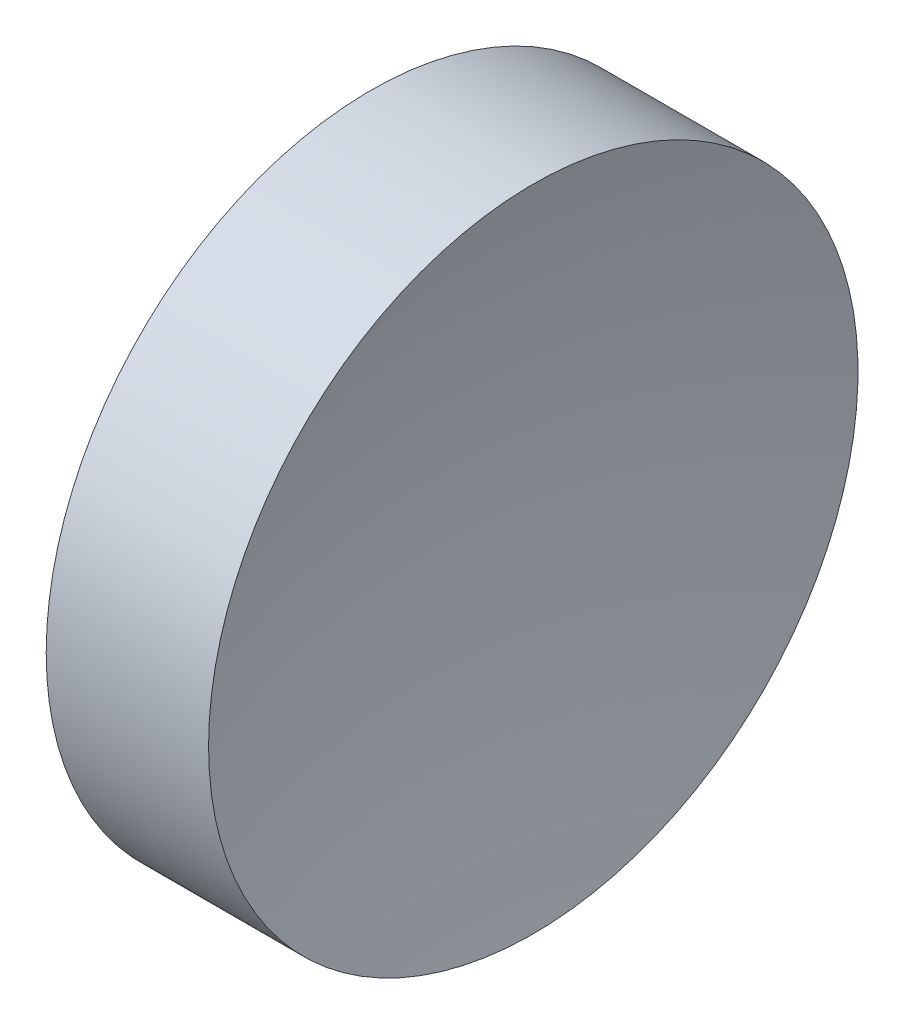
ISO-10303-21;
HEADER;
FILE_DESCRIPTION(('STEP AP214'),'2;1');
FILE_NAME('part.step','',(''),(''),'','','');
FILE_SCHEMA(('AUTOMOTIVE_DESIGN { 1 0 10303 214 1 1 1 1 }'));
ENDSEC;
DATA;
#1=APPLICATION_CONTEXT('core data for automotive mechanical design processes');
#2=APPLICATION_PROTOCOL_DEFINITION('international standard','automotive_design',2000,#1);
#3=PRODUCT_CONTEXT('',#1,'mechanical');
#4=PRODUCT('Part','Part','',(#3));
#5=PRODUCT_RELATED_PRODUCT_CATEGORY('part','',(#4));
#6=PRODUCT_DEFINITION_FORMATION('','',#4);
#7=PRODUCT_DEFINITION_CONTEXT('part definition',#1,'design');
#8=PRODUCT_DEFINITION('design','',#6,#7);
#9=PRODUCT_DEFINITION_SHAPE('','',#8);
#10=(LENGTH_UNIT() NAMED_UNIT(*) SI_UNIT(.MILLI.,.METRE.));
#11=(NAMED_UNIT(*) PLANE_ANGLE_UNIT() SI_UNIT($,.RADIAN.));
#12=(NAMED_UNIT(*) SI_UNIT($,.STERADIAN.) SOLID_ANGLE_UNIT());
#13=UNCERTAINTY_MEASURE_WITH_UNIT(LENGTH_MEASURE(1.E-05),#10,'distance_accuracy_value','');
#14=(GEOMETRIC_REPRESENTATION_CONTEXT(3) GLOBAL_UNCERTAINTY_ASSIGNED_CONTEXT((#13)) GLOBAL_UNIT_ASSIGNED_CONTEXT((#10,
#11,#12)) REPRESENTATION_CONTEXT('',''));
#15=CARTESIAN_POINT('',(0.,0.,0.));
#16=DIRECTION('',(0.,0.,1.));
#17=DIRECTION('',(1.,0.,0.));
#18=AXIS2_PLACEMENT_3D('',#15,#16,#17);
#19=CARTESIAN_POINT('',(0.,0.,0.));
#20=DIRECTION('',(1.,0.,0.));
#21=DIRECTION('',(0.,0.,-1.));
#22=AXIS2_PLACEMENT_3D('',#19,#20,#21);
#23=PLANE('',#22);
#24=CARTESIAN_POINT('',(0.,0.,0.));
#25=DIRECTION('',(-1.,0.,0.));
#26=DIRECTION('',(0.,0.,1.));
#27=AXIS2_PLACEMENT_3D('',#24,#25,#26);
#28=CIRCLE('',#27,12.7);
#29=CARTESIAN_POINT('',(0.,0.,12.7));
#30=VERTEX_POINT('',#29);
#31=EDGE_CURVE('E39',#30,#30,#28,.T.);
#32=ORIENTED_EDGE('',*,*,#31,.T.);
#33=EDGE_LOOP('',(#32));
#34=FACE_BOUND('',#33,.T.);
#35=ADVANCED_FACE('F33',(#34),#23,.F.);
#36=CARTESIAN_POINT('',(54.71,0.,0.));
#37=DIRECTION('',(-1.,0.,0.));
#38=DIRECTION('',(0.,0.,1.));
#39=AXIS2_PLACEMENT_3D('',#36,#37,#38);
#40=SPHERICAL_SURFACE('',#39,50.);
#41=CARTESIAN_POINT('',(6.34978908234581,0.,0.));
#42=DIRECTION('',(-1.,0.,0.));
#43=DIRECTION('',(0.,0.,1.));
#44=AXIS2_PLACEMENT_3D('',#41,#42,#43);
#45=CIRCLE('',#44,12.7);
#46=CARTESIAN_POINT('',(6.34978908234581,0.,12.7));
#47=VERTEX_POINT('',#46);
#48=EDGE_CURVE('E10',#47,#47,#45,.T.);
#49=ORIENTED_EDGE('',*,*,#48,.F.);
#50=EDGE_LOOP('',(#49));
#51=FACE_BOUND('',#50,.T.);
#52=ADVANCED_FACE('F48',(#51),#40,.F.);
#53=CARTESIAN_POINT('',(0.,0.,0.));
#54=DIRECTION('',(-1.,0.,0.));
#55=DIRECTION('',(0.,0.,1.));
#56=AXIS2_PLACEMENT_3D('',#53,#54,#55);
#57=CYLINDRICAL_SURFACE('',#56,12.7);
#58=ORIENTED_EDGE('',*,*,#31,.F.);
#59=EDGE_LOOP('',(#58));
#60=FACE_BOUND('',#59,.T.);
#61=ORIENTED_EDGE('',*,*,#48,.T.);
#62=EDGE_LOOP('',(#61));
#63=FACE_BOUND('',#62,.T.);
#64=ADVANCED_FACE('F46',(#60,#63),#57,.T.);
#65=CLOSED_SHELL('',(#35,#52,#64));
#66=MANIFOLD_SOLID_BREP('B2',#65);
#67=ADVANCED_BREP_SHAPE_REPRESENTATION('',(#18,#66),#14);
#68=SHAPE_DEFINITION_REPRESENTATION(#9,#67);
ENDSEC;
END-ISO-10303-21;
